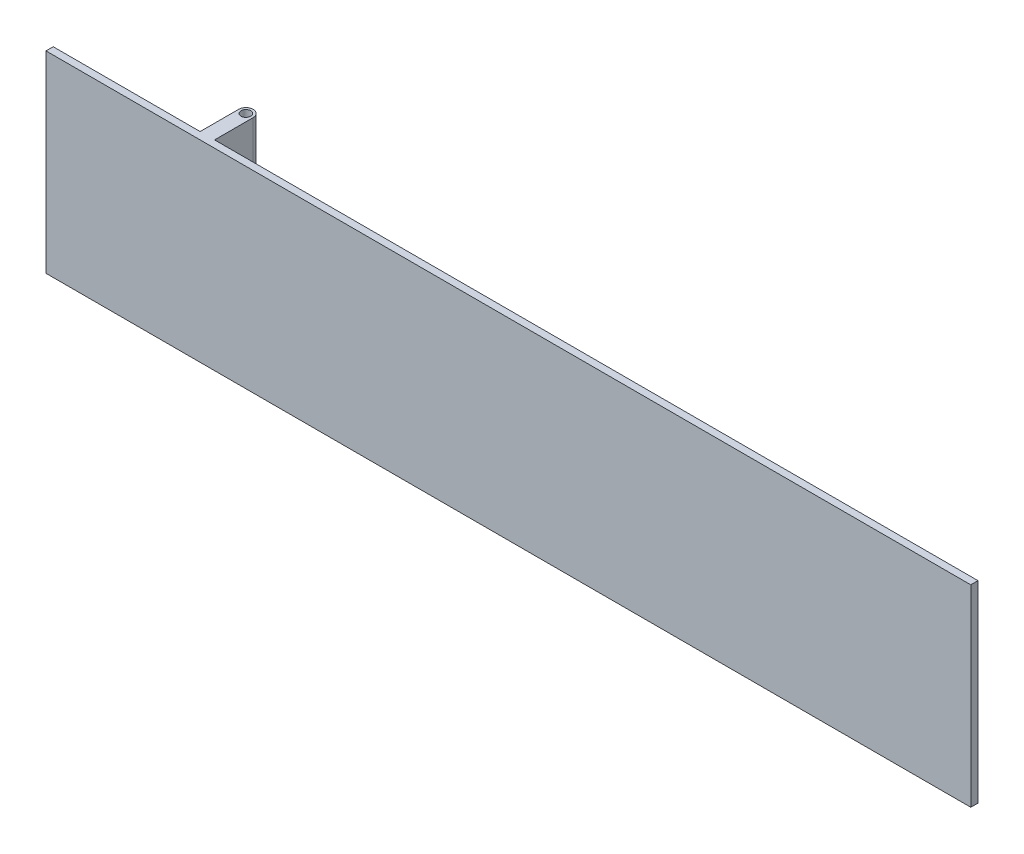
ISO-10303-21;
HEADER;
FILE_DESCRIPTION(('STEP AP214'),'2;1');
FILE_NAME('part.step','',(''),(''),'','','');
FILE_SCHEMA(('AUTOMOTIVE_DESIGN { 1 0 10303 214 1 1 1 1 }'));
ENDSEC;
DATA;
#1=APPLICATION_CONTEXT('core data for automotive mechanical design processes');
#2=APPLICATION_PROTOCOL_DEFINITION('international standard','automotive_design',2000,#1);
#3=PRODUCT_CONTEXT('',#1,'mechanical');
#4=PRODUCT('Part','Part','',(#3));
#5=PRODUCT_RELATED_PRODUCT_CATEGORY('part','',(#4));
#6=PRODUCT_DEFINITION_FORMATION('','',#4);
#7=PRODUCT_DEFINITION_CONTEXT('part definition',#1,'design');
#8=PRODUCT_DEFINITION('design','',#6,#7);
#9=PRODUCT_DEFINITION_SHAPE('','',#8);
#10=(LENGTH_UNIT() NAMED_UNIT(*) SI_UNIT(.MILLI.,.METRE.));
#11=(NAMED_UNIT(*) PLANE_ANGLE_UNIT() SI_UNIT($,.RADIAN.));
#12=(NAMED_UNIT(*) SI_UNIT($,.STERADIAN.) SOLID_ANGLE_UNIT());
#13=UNCERTAINTY_MEASURE_WITH_UNIT(LENGTH_MEASURE(1.E-05),#10,'distance_accuracy_value','');
#14=(GEOMETRIC_REPRESENTATION_CONTEXT(3) GLOBAL_UNCERTAINTY_ASSIGNED_CONTEXT((#13)) GLOBAL_UNIT_ASSIGNED_CONTEXT((#10,
#11,#12)) REPRESENTATION_CONTEXT('',''));
#15=CARTESIAN_POINT('',(0.,0.,0.));
#16=DIRECTION('',(0.,0.,1.));
#17=DIRECTION('',(1.,0.,0.));
#18=AXIS2_PLACEMENT_3D('',#15,#16,#17);
#19=CARTESIAN_POINT('',(-198.4375,63.5,-25.4));
#20=DIRECTION('',(-1.,0.,0.));
#21=DIRECTION('',(0.,0.,1.));
#22=AXIS2_PLACEMENT_3D('',#19,#20,#21);
#23=PLANE('',#22);
#24=DIRECTION('',(0.,-1.,0.));
#25=VECTOR('',#24,1.);
#26=CARTESIAN_POINT('',(-198.4375,63.5,0.));
#27=LINE('',#26,#25);
#28=CARTESIAN_POINT('',(-198.4375,63.5,0.));
#29=VERTEX_POINT('',#28);
#30=CARTESIAN_POINT('',(-198.4375,25.4,0.));
#31=VERTEX_POINT('',#30);
#32=EDGE_CURVE('E143',#29,#31,#27,.T.);
#33=ORIENTED_EDGE('',*,*,#32,.T.);
#34=DIRECTION('',(0.,0.,1.));
#35=VECTOR('',#34,1.);
#36=CARTESIAN_POINT('',(-198.4375,25.4,0.));
#37=LINE('',#36,#35);
#38=CARTESIAN_POINT('',(-198.4375,25.4,-25.4));
#39=VERTEX_POINT('',#38);
#40=EDGE_CURVE('E129',#39,#31,#37,.T.);
#41=ORIENTED_EDGE('',*,*,#40,.F.);
#42=DIRECTION('',(0.,-1.,0.));
#43=VECTOR('',#42,1.);
#44=CARTESIAN_POINT('',(-198.4375,63.5,-25.4));
#45=LINE('',#44,#43);
#46=CARTESIAN_POINT('',(-198.4375,63.5,-25.4));
#47=VERTEX_POINT('',#46);
#48=EDGE_CURVE('E144',#47,#39,#45,.T.);
#49=ORIENTED_EDGE('',*,*,#48,.F.);
#50=DIRECTION('',(0.,0.,-1.));
#51=VECTOR('',#50,1.);
#52=CARTESIAN_POINT('',(-198.4375,63.5,-25.4));
#53=LINE('',#52,#51);
#54=EDGE_CURVE('E203',#29,#47,#53,.T.);
#55=ORIENTED_EDGE('',*,*,#54,.F.);
#56=EDGE_LOOP('',(#33,#41,#49,#55));
#57=FACE_BOUND('',#56,.T.);
#58=ADVANCED_FACE('F32',(#57),#23,.F.);
#59=CARTESIAN_POINT('',(-203.2,63.5,-25.4));
#60=DIRECTION('',(0.,-1.,0.));
#61=DIRECTION('',(0.,0.,-1.));
#62=AXIS2_PLACEMENT_3D('',#59,#60,#61);
#63=CYLINDRICAL_SURFACE('',#62,4.7625);
#64=ORIENTED_EDGE('',*,*,#48,.T.);
#65=CARTESIAN_POINT('',(-203.2,25.4,-25.4));
#66=DIRECTION('',(0.,1.,0.));
#67=DIRECTION('',(0.,0.,1.));
#68=AXIS2_PLACEMENT_3D('',#65,#66,#67);
#69=CIRCLE('',#68,4.7625);
#70=CARTESIAN_POINT('',(-207.9625,25.4,-25.4));
#71=VERTEX_POINT('',#70);
#72=EDGE_CURVE('E194',#39,#71,#69,.T.);
#73=ORIENTED_EDGE('',*,*,#72,.T.);
#74=DIRECTION('',(0.,-1.,0.));
#75=VECTOR('',#74,1.);
#76=CARTESIAN_POINT('',(-207.9625,63.5,-25.4));
#77=LINE('',#76,#75);
#78=CARTESIAN_POINT('',(-207.9625,63.5,-25.4));
#79=VERTEX_POINT('',#78);
#80=EDGE_CURVE('E217',#79,#71,#77,.T.);
#81=ORIENTED_EDGE('',*,*,#80,.F.);
#82=CARTESIAN_POINT('',(-203.2,63.5,-25.4));
#83=DIRECTION('',(0.,1.,0.));
#84=DIRECTION('',(0.,0.,-1.));
#85=AXIS2_PLACEMENT_3D('',#82,#83,#84);
#86=CIRCLE('',#85,4.7625);
#87=EDGE_CURVE('E205',#47,#79,#86,.T.);
#88=ORIENTED_EDGE('',*,*,#87,.F.);
#89=EDGE_LOOP('',(#64,#73,#81,#88));
#90=FACE_BOUND('',#89,.T.);
#91=ADVANCED_FACE('F266',(#90),#63,.T.);
#92=CARTESIAN_POINT('',(-207.9625,63.5,0.));
#93=DIRECTION('',(1.,0.,0.));
#94=DIRECTION('',(0.,0.,-1.));
#95=AXIS2_PLACEMENT_3D('',#92,#93,#94);
#96=PLANE('',#95);
#97=ORIENTED_EDGE('',*,*,#80,.T.);
#98=DIRECTION('',(0.,0.,1.));
#99=VECTOR('',#98,1.);
#100=CARTESIAN_POINT('',(-207.9625,25.4,0.));
#101=LINE('',#100,#99);
#102=CARTESIAN_POINT('',(-207.9625,25.4,0.));
#103=VERTEX_POINT('',#102);
#104=EDGE_CURVE('E191',#71,#103,#101,.T.);
#105=ORIENTED_EDGE('',*,*,#104,.T.);
#106=DIRECTION('',(0.,-1.,0.));
#107=VECTOR('',#106,1.);
#108=CARTESIAN_POINT('',(-207.9625,63.5,0.));
#109=LINE('',#108,#107);
#110=CARTESIAN_POINT('',(-207.9625,63.5,0.));
#111=VERTEX_POINT('',#110);
#112=EDGE_CURVE('E215',#111,#103,#109,.T.);
#113=ORIENTED_EDGE('',*,*,#112,.F.);
#114=DIRECTION('',(0.,0.,1.));
#115=VECTOR('',#114,1.);
#116=CARTESIAN_POINT('',(-207.9625,63.5,0.));
#117=LINE('',#116,#115);
#118=EDGE_CURVE('E208',#79,#111,#117,.T.);
#119=ORIENTED_EDGE('',*,*,#118,.F.);
#120=EDGE_LOOP('',(#97,#105,#113,#119));
#121=FACE_BOUND('',#120,.T.);
#122=ADVANCED_FACE('F242',(#121),#96,.F.);
#123=CARTESIAN_POINT('',(-203.2,63.5,-25.4));
#124=DIRECTION('',(0.,-1.,0.));
#125=DIRECTION('',(0.,0.,-1.));
#126=AXIS2_PLACEMENT_3D('',#123,#124,#125);
#127=CYLINDRICAL_SURFACE('',#126,3.175);
#128=CARTESIAN_POINT('',(-203.2,25.4,-25.4));
#129=DIRECTION('',(0.,1.,0.));
#130=DIRECTION('',(0.,0.,1.));
#131=AXIS2_PLACEMENT_3D('',#128,#129,#130);
#132=CIRCLE('',#131,3.175);
#133=CARTESIAN_POINT('',(-203.2,25.4,-22.225));
#134=VERTEX_POINT('',#133);
#135=EDGE_CURVE('E36',#134,#134,#132,.T.);
#136=ORIENTED_EDGE('',*,*,#135,.F.);
#137=EDGE_LOOP('',(#136));
#138=FACE_BOUND('',#137,.T.);
#139=CARTESIAN_POINT('',(-203.2,63.5,-25.4));
#140=DIRECTION('',(0.,1.,0.));
#141=DIRECTION('',(0.,0.,1.));
#142=AXIS2_PLACEMENT_3D('',#139,#140,#141);
#143=CIRCLE('',#142,3.175);
#144=CARTESIAN_POINT('',(-203.2,63.5,-22.225));
#145=VERTEX_POINT('',#144);
#146=EDGE_CURVE('E197',#145,#145,#143,.T.);
#147=ORIENTED_EDGE('',*,*,#146,.T.);
#148=EDGE_LOOP('',(#147));
#149=FACE_BOUND('',#148,.T.);
#150=ADVANCED_FACE('F285',(#138,#149),#127,.F.);
#151=CARTESIAN_POINT('',(-304.8,-63.5,4.7625));
#152=DIRECTION('',(-1.,0.,0.));
#153=DIRECTION('',(0.,0.,1.));
#154=AXIS2_PLACEMENT_3D('',#151,#152,#153);
#155=PLANE('',#154);
#156=DIRECTION('',(0.,1.,0.));
#157=VECTOR('',#156,1.);
#158=CARTESIAN_POINT('',(-304.8,-63.5,0.));
#159=LINE('',#158,#157);
#160=CARTESIAN_POINT('',(-304.8,-63.5,0.));
#161=VERTEX_POINT('',#160);
#162=CARTESIAN_POINT('',(-304.8,63.5,0.));
#163=VERTEX_POINT('',#162);
#164=EDGE_CURVE('E147',#161,#163,#159,.T.);
#165=ORIENTED_EDGE('',*,*,#164,.F.);
#166=DIRECTION('',(0.,0.,-1.));
#167=VECTOR('',#166,1.);
#168=CARTESIAN_POINT('',(-304.8,-63.5,4.7625));
#169=LINE('',#168,#167);
#170=CARTESIAN_POINT('',(-304.8,-63.5,4.7625));
#171=VERTEX_POINT('',#170);
#172=EDGE_CURVE('E11',#171,#161,#169,.T.);
#173=ORIENTED_EDGE('',*,*,#172,.F.);
#174=DIRECTION('',(0.,1.,0.));
#175=VECTOR('',#174,1.);
#176=CARTESIAN_POINT('',(-304.8,-63.5,4.7625));
#177=LINE('',#176,#175);
#178=CARTESIAN_POINT('',(-304.8,63.5,4.7625));
#179=VERTEX_POINT('',#178);
#180=EDGE_CURVE('E152',#171,#179,#177,.T.);
#181=ORIENTED_EDGE('',*,*,#180,.T.);
#182=DIRECTION('',(0.,0.,-1.));
#183=VECTOR('',#182,1.);
#184=CARTESIAN_POINT('',(-304.8,63.5,4.7625));
#185=LINE('',#184,#183);
#186=EDGE_CURVE('E163',#179,#163,#185,.T.);
#187=ORIENTED_EDGE('',*,*,#186,.T.);
#188=EDGE_LOOP('',(#165,#173,#181,#187));
#189=FACE_BOUND('',#188,.T.);
#190=ADVANCED_FACE('F34',(#189),#155,.T.);
#191=CARTESIAN_POINT('',(-304.8,-63.5,4.7625));
#192=DIRECTION('',(0.,1.,0.));
#193=DIRECTION('',(0.,0.,1.));
#194=AXIS2_PLACEMENT_3D('',#191,#192,#193);
#195=PLANE('',#194);
#196=DIRECTION('',(1.,0.,0.));
#197=VECTOR('',#196,1.);
#198=CARTESIAN_POINT('',(-304.8,-63.5,0.));
#199=LINE('',#198,#197);
#200=CARTESIAN_POINT('',(-207.9625,-63.5,0.));
#201=VERTEX_POINT('',#200);
#202=EDGE_CURVE('E156',#161,#201,#199,.T.);
#203=ORIENTED_EDGE('',*,*,#202,.T.);
#204=DIRECTION('',(0.,0.,1.));
#205=VECTOR('',#204,1.);
#206=CARTESIAN_POINT('',(-207.9625,-63.5,0.));
#207=LINE('',#206,#205);
#208=CARTESIAN_POINT('',(-207.9625,-63.5,-25.4));
#209=VERTEX_POINT('',#208);
#210=EDGE_CURVE('E206',#209,#201,#207,.T.);
#211=ORIENTED_EDGE('',*,*,#210,.F.);
#212=CARTESIAN_POINT('',(-203.2,-63.5,-25.4));
#213=DIRECTION('',(0.,1.,0.));
#214=DIRECTION('',(0.,0.,-1.));
#215=AXIS2_PLACEMENT_3D('',#212,#213,#214);
#216=CIRCLE('',#215,4.7625);
#217=CARTESIAN_POINT('',(-198.4375,-63.5,-25.4));
#218=VERTEX_POINT('',#217);
#219=EDGE_CURVE('E211',#218,#209,#216,.T.);
#220=ORIENTED_EDGE('',*,*,#219,.F.);
#221=DIRECTION('',(0.,0.,-1.));
#222=VECTOR('',#221,1.);
#223=CARTESIAN_POINT('',(-198.4375,-63.5,-25.4));
#224=LINE('',#223,#222);
#225=CARTESIAN_POINT('',(-198.4375,-63.5,0.));
#226=VERTEX_POINT('',#225);
#227=EDGE_CURVE('E200',#226,#218,#224,.T.);
#228=ORIENTED_EDGE('',*,*,#227,.F.);
#229=CARTESIAN_POINT('',(304.8,-63.5,0.));
#230=VERTEX_POINT('',#229);
#231=EDGE_CURVE('E142',#226,#230,#199,.T.);
#232=ORIENTED_EDGE('',*,*,#231,.T.);
#233=DIRECTION('',(0.,0.,-1.));
#234=VECTOR('',#233,1.);
#235=CARTESIAN_POINT('',(304.8,-63.5,4.7625));
#236=LINE('',#235,#234);
#237=CARTESIAN_POINT('',(304.8,-63.5,4.7625));
#238=VERTEX_POINT('',#237);
#239=EDGE_CURVE('E41',#238,#230,#236,.T.);
#240=ORIENTED_EDGE('',*,*,#239,.F.);
#241=DIRECTION('',(1.,0.,0.));
#242=VECTOR('',#241,1.);
#243=CARTESIAN_POINT('',(-304.8,-63.5,4.7625));
#244=LINE('',#243,#242);
#245=EDGE_CURVE('E161',#171,#238,#244,.T.);
#246=ORIENTED_EDGE('',*,*,#245,.F.);
#247=ORIENTED_EDGE('',*,*,#172,.T.);
#248=EDGE_LOOP('',(#203,#211,#220,#228,#232,#240,#246,#247));
#249=FACE_BOUND('',#248,.T.);
#250=CARTESIAN_POINT('',(-203.2,-63.5,-25.4));
#251=DIRECTION('',(0.,1.,0.));
#252=DIRECTION('',(0.,0.,1.));
#253=AXIS2_PLACEMENT_3D('',#250,#251,#252);
#254=CIRCLE('',#253,3.175);
#255=CARTESIAN_POINT('',(-203.2,-63.5,-22.225));
#256=VERTEX_POINT('',#255);
#257=EDGE_CURVE('E196',#256,#256,#254,.T.);
#258=ORIENTED_EDGE('',*,*,#257,.T.);
#259=EDGE_LOOP('',(#258));
#260=FACE_BOUND('',#259,.T.);
#261=ADVANCED_FACE('F230',(#249,#260),#195,.F.);
#262=CARTESIAN_POINT('',(304.8,-63.5,4.7625));
#263=DIRECTION('',(-1.,0.,0.));
#264=DIRECTION('',(0.,0.,1.));
#265=AXIS2_PLACEMENT_3D('',#262,#263,#264);
#266=PLANE('',#265);
#267=DIRECTION('',(0.,1.,0.));
#268=VECTOR('',#267,1.);
#269=CARTESIAN_POINT('',(304.8,-63.5,0.));
#270=LINE('',#269,#268);
#271=CARTESIAN_POINT('',(304.8,63.5,0.));
#272=VERTEX_POINT('',#271);
#273=EDGE_CURVE('E169',#230,#272,#270,.T.);
#274=ORIENTED_EDGE('',*,*,#273,.T.);
#275=DIRECTION('',(0.,0.,-1.));
#276=VECTOR('',#275,1.);
#277=CARTESIAN_POINT('',(304.8,63.5,4.7625));
#278=LINE('',#277,#276);
#279=CARTESIAN_POINT('',(304.8,63.5,4.7625));
#280=VERTEX_POINT('',#279);
#281=EDGE_CURVE('E176',#280,#272,#278,.T.);
#282=ORIENTED_EDGE('',*,*,#281,.F.);
#283=DIRECTION('',(0.,1.,0.));
#284=VECTOR('',#283,1.);
#285=CARTESIAN_POINT('',(304.8,-63.5,4.7625));
#286=LINE('',#285,#284);
#287=EDGE_CURVE('E159',#238,#280,#286,.T.);
#288=ORIENTED_EDGE('',*,*,#287,.F.);
#289=ORIENTED_EDGE('',*,*,#239,.T.);
#290=EDGE_LOOP('',(#274,#282,#288,#289));
#291=FACE_BOUND('',#290,.T.);
#292=ADVANCED_FACE('F253',(#291),#266,.F.);
#293=CARTESIAN_POINT('',(-304.8,63.5,4.7625));
#294=DIRECTION('',(0.,1.,0.));
#295=DIRECTION('',(0.,0.,1.));
#296=AXIS2_PLACEMENT_3D('',#293,#294,#295);
#297=PLANE('',#296);
#298=DIRECTION('',(1.,0.,0.));
#299=VECTOR('',#298,1.);
#300=CARTESIAN_POINT('',(-304.8,63.5,0.));
#301=LINE('',#300,#299);
#302=EDGE_CURVE('E166',#163,#111,#301,.T.);
#303=ORIENTED_EDGE('',*,*,#302,.F.);
#304=ORIENTED_EDGE('',*,*,#186,.F.);
#305=DIRECTION('',(1.,0.,0.));
#306=VECTOR('',#305,1.);
#307=CARTESIAN_POINT('',(-304.8,63.5,4.7625));
#308=LINE('',#307,#306);
#309=EDGE_CURVE('E155',#179,#280,#308,.T.);
#310=ORIENTED_EDGE('',*,*,#309,.T.);
#311=ORIENTED_EDGE('',*,*,#281,.T.);
#312=EDGE_CURVE('E165',#29,#272,#301,.T.);
#313=ORIENTED_EDGE('',*,*,#312,.F.);
#314=ORIENTED_EDGE('',*,*,#54,.T.);
#315=ORIENTED_EDGE('',*,*,#87,.T.);
#316=ORIENTED_EDGE('',*,*,#118,.T.);
#317=EDGE_LOOP('',(#303,#304,#310,#311,#313,#314,#315,#316));
#318=FACE_BOUND('',#317,.T.);
#319=ORIENTED_EDGE('',*,*,#146,.F.);
#320=EDGE_LOOP('',(#319));
#321=FACE_BOUND('',#320,.T.);
#322=ADVANCED_FACE('F239',(#318,#321),#297,.T.);
#323=CARTESIAN_POINT('',(0.,0.,4.7625));
#324=DIRECTION('',(0.,0.,-1.));
#325=DIRECTION('',(-1.,0.,0.));
#326=AXIS2_PLACEMENT_3D('',#323,#324,#325);
#327=PLANE('',#326);
#328=ORIENTED_EDGE('',*,*,#180,.F.);
#329=ORIENTED_EDGE('',*,*,#245,.T.);
#330=ORIENTED_EDGE('',*,*,#287,.T.);
#331=ORIENTED_EDGE('',*,*,#309,.F.);
#332=EDGE_LOOP('',(#328,#329,#330,#331));
#333=FACE_BOUND('',#332,.T.);
#334=ADVANCED_FACE('F256',(#333),#327,.F.);
#335=CARTESIAN_POINT('',(0.,0.,0.));
#336=DIRECTION('',(0.,0.,-1.));
#337=DIRECTION('',(-1.,0.,0.));
#338=AXIS2_PLACEMENT_3D('',#335,#336,#337);
#339=PLANE('',#338);
#340=ORIENTED_EDGE('',*,*,#32,.F.);
#341=ORIENTED_EDGE('',*,*,#312,.T.);
#342=ORIENTED_EDGE('',*,*,#273,.F.);
#343=ORIENTED_EDGE('',*,*,#231,.F.);
#344=CARTESIAN_POINT('',(-198.4375,-25.4,0.));
#345=VERTEX_POINT('',#344);
#346=EDGE_CURVE('E134',#345,#226,#27,.T.);
#347=ORIENTED_EDGE('',*,*,#346,.F.);
#348=DIRECTION('',(1.,0.,0.));
#349=VECTOR('',#348,1.);
#350=CARTESIAN_POINT('',(-304.8,-25.4,0.));
#351=LINE('',#350,#349);
#352=CARTESIAN_POINT('',(-207.9625,-25.4,0.));
#353=VERTEX_POINT('',#352);
#354=EDGE_CURVE('E121',#353,#345,#351,.T.);
#355=ORIENTED_EDGE('',*,*,#354,.F.);
#356=EDGE_CURVE('E57',#353,#201,#109,.T.);
#357=ORIENTED_EDGE('',*,*,#356,.T.);
#358=ORIENTED_EDGE('',*,*,#202,.F.);
#359=ORIENTED_EDGE('',*,*,#164,.T.);
#360=ORIENTED_EDGE('',*,*,#302,.T.);
#361=ORIENTED_EDGE('',*,*,#112,.T.);
#362=DIRECTION('',(1.,0.,0.));
#363=VECTOR('',#362,1.);
#364=CARTESIAN_POINT('',(-304.8,25.4,0.));
#365=LINE('',#364,#363);
#366=EDGE_CURVE('E128',#103,#31,#365,.T.);
#367=ORIENTED_EDGE('',*,*,#366,.T.);
#368=EDGE_LOOP('',(#340,#341,#342,#343,#347,#355,#357,#358,#359,#360,#361,#367));
#369=FACE_BOUND('',#368,.T.);
#370=ADVANCED_FACE('F140',(#369),#339,.T.);
#371=CARTESIAN_POINT('',(-198.4375,-25.4,-25.4));
#372=VERTEX_POINT('',#371);
#373=EDGE_CURVE('E136',#372,#218,#45,.T.);
#374=ORIENTED_EDGE('',*,*,#373,.F.);
#375=DIRECTION('',(0.,0.,-1.));
#376=VECTOR('',#375,1.);
#377=CARTESIAN_POINT('',(-198.4375,-25.4,-30.1625));
#378=LINE('',#377,#376);
#379=EDGE_CURVE('E124',#345,#372,#378,.T.);
#380=ORIENTED_EDGE('',*,*,#379,.F.);
#381=ORIENTED_EDGE('',*,*,#346,.T.);
#382=ORIENTED_EDGE('',*,*,#227,.T.);
#383=EDGE_LOOP('',(#374,#380,#381,#382));
#384=FACE_BOUND('',#383,.T.);
#385=ADVANCED_FACE('F132',(#384),#23,.F.);
#386=CARTESIAN_POINT('',(-203.2,-25.4,-25.4));
#387=DIRECTION('',(0.,-1.,0.));
#388=DIRECTION('',(0.,0.,-1.));
#389=AXIS2_PLACEMENT_3D('',#386,#387,#388);
#390=CIRCLE('',#389,4.7625);
#391=CARTESIAN_POINT('',(-207.9625,-25.4,-25.4));
#392=VERTEX_POINT('',#391);
#393=EDGE_CURVE('E49',#392,#372,#390,.T.);
#394=ORIENTED_EDGE('',*,*,#393,.T.);
#395=ORIENTED_EDGE('',*,*,#373,.T.);
#396=ORIENTED_EDGE('',*,*,#219,.T.);
#397=EDGE_CURVE('E216',#392,#209,#77,.T.);
#398=ORIENTED_EDGE('',*,*,#397,.F.);
#399=EDGE_LOOP('',(#394,#395,#396,#398));
#400=FACE_BOUND('',#399,.T.);
#401=ADVANCED_FACE('F228',(#400),#63,.T.);
#402=ORIENTED_EDGE('',*,*,#356,.F.);
#403=DIRECTION('',(0.,0.,-1.));
#404=VECTOR('',#403,1.);
#405=CARTESIAN_POINT('',(-207.9625,-25.4,0.));
#406=LINE('',#405,#404);
#407=EDGE_CURVE('E126',#353,#392,#406,.T.);
#408=ORIENTED_EDGE('',*,*,#407,.T.);
#409=ORIENTED_EDGE('',*,*,#397,.T.);
#410=ORIENTED_EDGE('',*,*,#210,.T.);
#411=EDGE_LOOP('',(#402,#408,#409,#410));
#412=FACE_BOUND('',#411,.T.);
#413=ADVANCED_FACE('F224',(#412),#96,.F.);
#414=CARTESIAN_POINT('',(-203.2,-25.4,-25.4));
#415=DIRECTION('',(0.,-1.,0.));
#416=DIRECTION('',(0.,0.,-1.));
#417=AXIS2_PLACEMENT_3D('',#414,#415,#416);
#418=CIRCLE('',#417,3.175);
#419=CARTESIAN_POINT('',(-203.2,-25.4,-28.575));
#420=VERTEX_POINT('',#419);
#421=EDGE_CURVE('E180',#420,#420,#418,.T.);
#422=ORIENTED_EDGE('',*,*,#421,.F.);
#423=EDGE_LOOP('',(#422));
#424=FACE_BOUND('',#423,.T.);
#425=ORIENTED_EDGE('',*,*,#257,.F.);
#426=EDGE_LOOP('',(#425));
#427=FACE_BOUND('',#426,.T.);
#428=ADVANCED_FACE('F279',(#424,#427),#127,.F.);
#429=CARTESIAN_POINT('',(-304.8,25.4,0.));
#430=DIRECTION('',(0.,1.,0.));
#431=DIRECTION('',(0.,0.,1.));
#432=AXIS2_PLACEMENT_3D('',#429,#430,#431);
#433=PLANE('',#432);
#434=ORIENTED_EDGE('',*,*,#135,.T.);
#435=EDGE_LOOP('',(#434));
#436=FACE_BOUND('',#435,.T.);
#437=ORIENTED_EDGE('',*,*,#40,.T.);
#438=ORIENTED_EDGE('',*,*,#366,.F.);
#439=ORIENTED_EDGE('',*,*,#104,.F.);
#440=ORIENTED_EDGE('',*,*,#72,.F.);
#441=EDGE_LOOP('',(#437,#438,#439,#440));
#442=FACE_BOUND('',#441,.T.);
#443=ADVANCED_FACE('F245',(#436,#442),#433,.F.);
#444=CARTESIAN_POINT('',(-304.8,-25.4,-30.1625));
#445=DIRECTION('',(0.,-1.,0.));
#446=DIRECTION('',(0.,0.,-1.));
#447=AXIS2_PLACEMENT_3D('',#444,#445,#446);
#448=PLANE('',#447);
#449=ORIENTED_EDGE('',*,*,#421,.T.);
#450=EDGE_LOOP('',(#449));
#451=FACE_BOUND('',#450,.T.);
#452=ORIENTED_EDGE('',*,*,#393,.F.);
#453=ORIENTED_EDGE('',*,*,#407,.F.);
#454=ORIENTED_EDGE('',*,*,#354,.T.);
#455=ORIENTED_EDGE('',*,*,#379,.T.);
#456=EDGE_LOOP('',(#452,#453,#454,#455));
#457=FACE_BOUND('',#456,.T.);
#458=ADVANCED_FACE('F123',(#451,#457),#448,.F.);
#459=CLOSED_SHELL('',(#58,#91,#122,#150,#190,#261,#292,#322,#334,#370,#385,#401,#413,#428,#443,#458));
#460=MANIFOLD_SOLID_BREP('B2',#459);
#461=ADVANCED_BREP_SHAPE_REPRESENTATION('',(#18,#460),#14);
#462=SHAPE_DEFINITION_REPRESENTATION(#9,#461);
ENDSEC;
END-ISO-10303-21;
